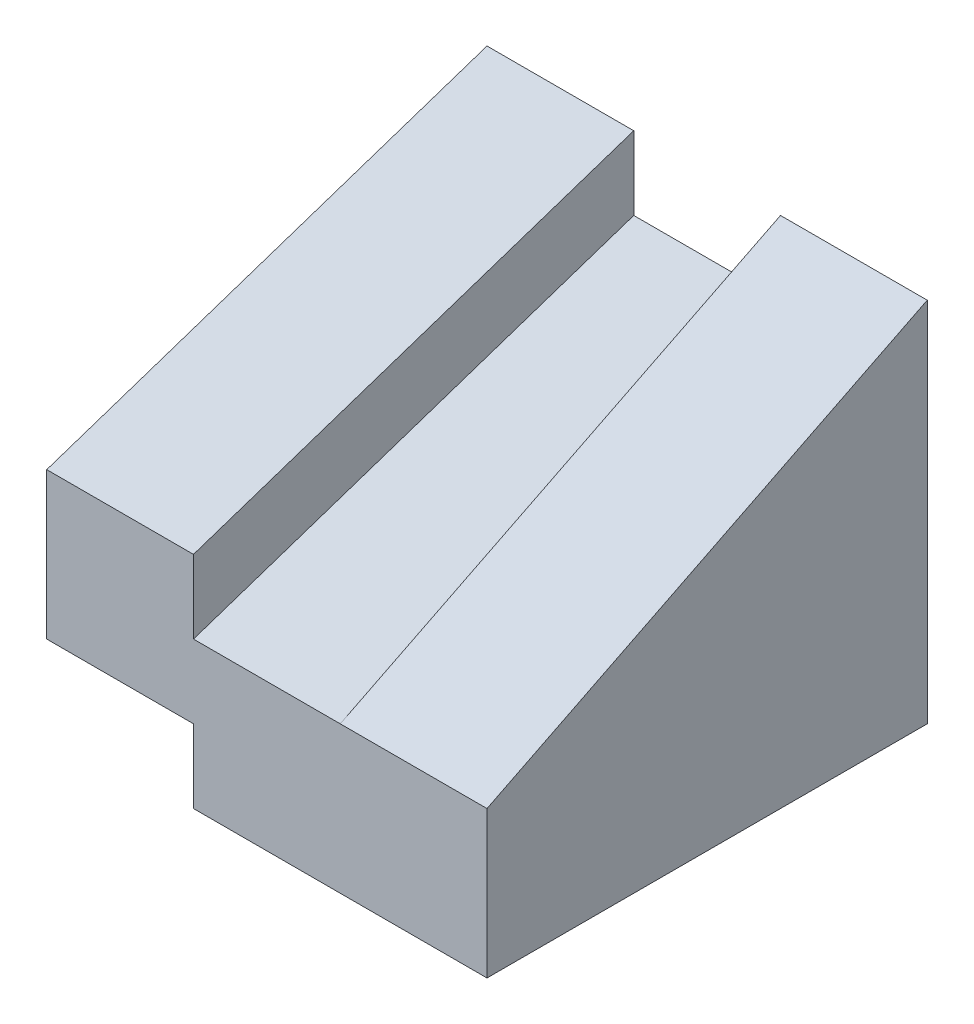
ISO-10303-21;
HEADER;
FILE_DESCRIPTION(('STEP AP214'),'2;1');
FILE_NAME('part.step','',(''),(''),'','','');
FILE_SCHEMA(('AUTOMOTIVE_DESIGN { 1 0 10303 214 1 1 1 1 }'));
ENDSEC;
DATA;
#1=APPLICATION_CONTEXT('core data for automotive mechanical design processes');
#2=APPLICATION_PROTOCOL_DEFINITION('international standard','automotive_design',2000,#1);
#3=PRODUCT_CONTEXT('',#1,'mechanical');
#4=PRODUCT('Part','Part','',(#3));
#5=PRODUCT_RELATED_PRODUCT_CATEGORY('part','',(#4));
#6=PRODUCT_DEFINITION_FORMATION('','',#4);
#7=PRODUCT_DEFINITION_CONTEXT('part definition',#1,'design');
#8=PRODUCT_DEFINITION('design','',#6,#7);
#9=PRODUCT_DEFINITION_SHAPE('','',#8);
#10=(LENGTH_UNIT() NAMED_UNIT(*) SI_UNIT(.MILLI.,.METRE.));
#11=(NAMED_UNIT(*) PLANE_ANGLE_UNIT() SI_UNIT($,.RADIAN.));
#12=(NAMED_UNIT(*) SI_UNIT($,.STERADIAN.) SOLID_ANGLE_UNIT());
#13=UNCERTAINTY_MEASURE_WITH_UNIT(LENGTH_MEASURE(1.E-05),#10,'distance_accuracy_value','');
#14=(GEOMETRIC_REPRESENTATION_CONTEXT(3) GLOBAL_UNCERTAINTY_ASSIGNED_CONTEXT((#13)) GLOBAL_UNIT_ASSIGNED_CONTEXT((#10,
#11,#12)) REPRESENTATION_CONTEXT('',''));
#15=CARTESIAN_POINT('',(0.,0.,0.));
#16=DIRECTION('',(0.,0.,1.));
#17=DIRECTION('',(1.,0.,0.));
#18=AXIS2_PLACEMENT_3D('',#15,#16,#17);
#19=CARTESIAN_POINT('',(-3.,5.,-3.));
#20=DIRECTION('',(0.,0.,1.));
#21=DIRECTION('',(1.,0.,0.));
#22=AXIS2_PLACEMENT_3D('',#19,#20,#21);
#23=PLANE('',#22);
#24=DIRECTION('',(0.,-1.,0.));
#25=VECTOR('',#24,1.);
#26=CARTESIAN_POINT('',(1.,0.,-3.));
#27=LINE('',#26,#25);
#28=CARTESIAN_POINT('',(1.,5.,-3.));
#29=VERTEX_POINT('',#28);
#30=CARTESIAN_POINT('',(1.,4.,-3.));
#31=VERTEX_POINT('',#30);
#32=EDGE_CURVE('E122',#29,#31,#27,.T.);
#33=ORIENTED_EDGE('',*,*,#32,.F.);
#34=DIRECTION('',(-1.,0.,0.));
#35=VECTOR('',#34,1.);
#36=CARTESIAN_POINT('',(-3.,5.,-3.));
#37=LINE('',#36,#35);
#38=CARTESIAN_POINT('',(3.,5.,-3.));
#39=VERTEX_POINT('',#38);
#40=EDGE_CURVE('E111',#39,#29,#37,.T.);
#41=ORIENTED_EDGE('',*,*,#40,.F.);
#42=DIRECTION('',(0.,-1.,0.));
#43=VECTOR('',#42,1.);
#44=CARTESIAN_POINT('',(3.,5.,-3.));
#45=LINE('',#44,#43);
#46=CARTESIAN_POINT('',(3.,0.,-3.));
#47=VERTEX_POINT('',#46);
#48=EDGE_CURVE('E11',#39,#47,#45,.T.);
#49=ORIENTED_EDGE('',*,*,#48,.T.);
#50=DIRECTION('',(-1.,0.,0.));
#51=VECTOR('',#50,1.);
#52=CARTESIAN_POINT('',(-3.,0.,-3.));
#53=LINE('',#52,#51);
#54=CARTESIAN_POINT('',(-1.,0.,-3.));
#55=VERTEX_POINT('',#54);
#56=EDGE_CURVE('E129',#47,#55,#53,.T.);
#57=ORIENTED_EDGE('',*,*,#56,.T.);
#58=DIRECTION('',(0.,1.,0.));
#59=VECTOR('',#58,1.);
#60=CARTESIAN_POINT('',(-1.,0.,-3.));
#61=LINE('',#60,#59);
#62=CARTESIAN_POINT('',(-1.,1.,-3.));
#63=VERTEX_POINT('',#62);
#64=EDGE_CURVE('E48',#55,#63,#61,.T.);
#65=ORIENTED_EDGE('',*,*,#64,.T.);
#66=DIRECTION('',(-1.,0.,0.));
#67=VECTOR('',#66,1.);
#68=CARTESIAN_POINT('',(-1.,1.,-3.));
#69=LINE('',#68,#67);
#70=CARTESIAN_POINT('',(-3.,1.,-3.));
#71=VERTEX_POINT('',#70);
#72=EDGE_CURVE('E154',#63,#71,#69,.T.);
#73=ORIENTED_EDGE('',*,*,#72,.T.);
#74=DIRECTION('',(0.,-1.,0.));
#75=VECTOR('',#74,1.);
#76=CARTESIAN_POINT('',(-3.,5.,-3.));
#77=LINE('',#76,#75);
#78=CARTESIAN_POINT('',(-3.,5.,-3.));
#79=VERTEX_POINT('',#78);
#80=EDGE_CURVE('E41',#79,#71,#77,.T.);
#81=ORIENTED_EDGE('',*,*,#80,.F.);
#82=DIRECTION('',(-1.,0.,0.));
#83=VECTOR('',#82,1.);
#84=CARTESIAN_POINT('',(-1.,5.,-3.));
#85=LINE('',#84,#83);
#86=CARTESIAN_POINT('',(-1.,5.,-3.));
#87=VERTEX_POINT('',#86);
#88=EDGE_CURVE('E134',#87,#79,#85,.T.);
#89=ORIENTED_EDGE('',*,*,#88,.F.);
#90=DIRECTION('',(0.,-1.,0.));
#91=VECTOR('',#90,1.);
#92=CARTESIAN_POINT('',(-1.,0.,-3.));
#93=LINE('',#92,#91);
#94=CARTESIAN_POINT('',(-1.,4.,-3.));
#95=VERTEX_POINT('',#94);
#96=EDGE_CURVE('E193',#87,#95,#93,.T.);
#97=ORIENTED_EDGE('',*,*,#96,.T.);
#98=DIRECTION('',(-1.,0.,0.));
#99=VECTOR('',#98,1.);
#100=CARTESIAN_POINT('',(1.,4.,-3.));
#101=LINE('',#100,#99);
#102=EDGE_CURVE('E186',#31,#95,#101,.T.);
#103=ORIENTED_EDGE('',*,*,#102,.F.);
#104=EDGE_LOOP('',(#33,#41,#49,#57,#65,#73,#81,#89,#97,#103));
#105=FACE_BOUND('',#104,.T.);
#106=ADVANCED_FACE('F33',(#105),#23,.F.);
#107=CARTESIAN_POINT('',(-3.,5.,3.));
#108=DIRECTION('',(0.,0.,-1.));
#109=DIRECTION('',(-1.,0.,0.));
#110=AXIS2_PLACEMENT_3D('',#107,#108,#109);
#111=PLANE('',#110);
#112=DIRECTION('',(0.,-1.,0.));
#113=VECTOR('',#112,1.);
#114=CARTESIAN_POINT('',(3.,5.,3.));
#115=LINE('',#114,#113);
#116=CARTESIAN_POINT('',(3.,2.,3.));
#117=VERTEX_POINT('',#116);
#118=CARTESIAN_POINT('',(3.,0.,3.));
#119=VERTEX_POINT('',#118);
#120=EDGE_CURVE('E56',#117,#119,#115,.T.);
#121=ORIENTED_EDGE('',*,*,#120,.F.);
#122=DIRECTION('',(-1.,0.,0.));
#123=VECTOR('',#122,1.);
#124=CARTESIAN_POINT('',(3.,2.,3.));
#125=LINE('',#124,#123);
#126=CARTESIAN_POINT('',(1.,2.,3.));
#127=VERTEX_POINT('',#126);
#128=EDGE_CURVE('E114',#117,#127,#125,.T.);
#129=ORIENTED_EDGE('',*,*,#128,.T.);
#130=DIRECTION('',(-1.,0.,0.));
#131=VECTOR('',#130,1.);
#132=CARTESIAN_POINT('',(1.,2.,3.));
#133=LINE('',#132,#131);
#134=CARTESIAN_POINT('',(-1.,2.,3.));
#135=VERTEX_POINT('',#134);
#136=EDGE_CURVE('E160',#127,#135,#133,.T.);
#137=ORIENTED_EDGE('',*,*,#136,.T.);
#138=DIRECTION('',(0.,1.,0.));
#139=VECTOR('',#138,1.);
#140=CARTESIAN_POINT('',(-1.,0.,3.));
#141=LINE('',#140,#139);
#142=CARTESIAN_POINT('',(-1.,3.,3.));
#143=VERTEX_POINT('',#142);
#144=EDGE_CURVE('E178',#135,#143,#141,.T.);
#145=ORIENTED_EDGE('',*,*,#144,.T.);
#146=DIRECTION('',(-1.,0.,0.));
#147=VECTOR('',#146,1.);
#148=CARTESIAN_POINT('',(-1.,3.,3.));
#149=LINE('',#148,#147);
#150=CARTESIAN_POINT('',(-3.,3.,3.));
#151=VERTEX_POINT('',#150);
#152=EDGE_CURVE('E130',#143,#151,#149,.T.);
#153=ORIENTED_EDGE('',*,*,#152,.T.);
#154=DIRECTION('',(0.,-1.,0.));
#155=VECTOR('',#154,1.);
#156=CARTESIAN_POINT('',(-3.,5.,3.));
#157=LINE('',#156,#155);
#158=CARTESIAN_POINT('',(-3.,1.,3.));
#159=VERTEX_POINT('',#158);
#160=EDGE_CURVE('E140',#151,#159,#157,.T.);
#161=ORIENTED_EDGE('',*,*,#160,.T.);
#162=DIRECTION('',(-1.,0.,0.));
#163=VECTOR('',#162,1.);
#164=CARTESIAN_POINT('',(-1.,1.,3.));
#165=LINE('',#164,#163);
#166=CARTESIAN_POINT('',(-1.,1.,3.));
#167=VERTEX_POINT('',#166);
#168=EDGE_CURVE('E156',#167,#159,#165,.T.);
#169=ORIENTED_EDGE('',*,*,#168,.F.);
#170=DIRECTION('',(0.,1.,0.));
#171=VECTOR('',#170,1.);
#172=CARTESIAN_POINT('',(-1.,0.,3.));
#173=LINE('',#172,#171);
#174=CARTESIAN_POINT('',(-1.,0.,3.));
#175=VERTEX_POINT('',#174);
#176=EDGE_CURVE('E167',#175,#167,#173,.T.);
#177=ORIENTED_EDGE('',*,*,#176,.F.);
#178=DIRECTION('',(1.,0.,0.));
#179=VECTOR('',#178,1.);
#180=CARTESIAN_POINT('',(-3.,0.,3.));
#181=LINE('',#180,#179);
#182=EDGE_CURVE('E123',#175,#119,#181,.T.);
#183=ORIENTED_EDGE('',*,*,#182,.T.);
#184=EDGE_LOOP('',(#121,#129,#137,#145,#153,#161,#169,#177,#183));
#185=FACE_BOUND('',#184,.T.);
#186=ADVANCED_FACE('F174',(#185),#111,.F.);
#187=CARTESIAN_POINT('',(-3.,5.,3.));
#188=DIRECTION('',(1.,0.,0.));
#189=DIRECTION('',(0.,0.,-1.));
#190=AXIS2_PLACEMENT_3D('',#187,#188,#189);
#191=PLANE('',#190);
#192=ORIENTED_EDGE('',*,*,#160,.F.);
#193=DIRECTION('',(0.,-0.316227766016838,0.948683298050514));
#194=VECTOR('',#193,1.);
#195=CARTESIAN_POINT('',(-3.,3.6,1.2));
#196=LINE('',#195,#194);
#197=EDGE_CURVE('E150',#79,#151,#196,.T.);
#198=ORIENTED_EDGE('',*,*,#197,.F.);
#199=ORIENTED_EDGE('',*,*,#80,.T.);
#200=DIRECTION('',(0.,0.,1.));
#201=VECTOR('',#200,1.);
#202=CARTESIAN_POINT('',(-3.,1.,-3.));
#203=LINE('',#202,#201);
#204=EDGE_CURVE('E149',#71,#159,#203,.T.);
#205=ORIENTED_EDGE('',*,*,#204,.T.);
#206=EDGE_LOOP('',(#192,#198,#199,#205));
#207=FACE_BOUND('',#206,.T.);
#208=ADVANCED_FACE('F148',(#207),#191,.F.);
#209=CARTESIAN_POINT('',(0.,0.,0.));
#210=DIRECTION('',(0.,-1.,0.));
#211=DIRECTION('',(0.,0.,-1.));
#212=AXIS2_PLACEMENT_3D('',#209,#210,#211);
#213=PLANE('',#212);
#214=ORIENTED_EDGE('',*,*,#182,.F.);
#215=DIRECTION('',(0.,0.,1.));
#216=VECTOR('',#215,1.);
#217=CARTESIAN_POINT('',(-1.,0.,-3.));
#218=LINE('',#217,#216);
#219=EDGE_CURVE('E158',#55,#175,#218,.T.);
#220=ORIENTED_EDGE('',*,*,#219,.F.);
#221=ORIENTED_EDGE('',*,*,#56,.F.);
#222=DIRECTION('',(0.,0.,-1.));
#223=VECTOR('',#222,1.);
#224=CARTESIAN_POINT('',(3.,0.,3.));
#225=LINE('',#224,#223);
#226=EDGE_CURVE('E126',#119,#47,#225,.T.);
#227=ORIENTED_EDGE('',*,*,#226,.F.);
#228=EDGE_LOOP('',(#214,#220,#221,#227));
#229=FACE_BOUND('',#228,.T.);
#230=ADVANCED_FACE('F225',(#229),#213,.T.);
#231=CARTESIAN_POINT('',(3.,5.,3.));
#232=DIRECTION('',(-1.,0.,0.));
#233=DIRECTION('',(0.,0.,1.));
#234=AXIS2_PLACEMENT_3D('',#231,#232,#233);
#235=PLANE('',#234);
#236=ORIENTED_EDGE('',*,*,#48,.F.);
#237=DIRECTION('',(0.,-0.447213595499958,0.894427190999916));
#238=VECTOR('',#237,1.);
#239=CARTESIAN_POINT('',(3.,2.8,1.4));
#240=LINE('',#239,#238);
#241=EDGE_CURVE('E108',#39,#117,#240,.T.);
#242=ORIENTED_EDGE('',*,*,#241,.T.);
#243=ORIENTED_EDGE('',*,*,#120,.T.);
#244=ORIENTED_EDGE('',*,*,#226,.T.);
#245=EDGE_LOOP('',(#236,#242,#243,#244));
#246=FACE_BOUND('',#245,.T.);
#247=ADVANCED_FACE('F35',(#246),#235,.F.);
#248=CARTESIAN_POINT('',(-1.,1.,-3.));
#249=DIRECTION('',(0.,-1.,0.));
#250=DIRECTION('',(0.,0.,-1.));
#251=AXIS2_PLACEMENT_3D('',#248,#249,#250);
#252=PLANE('',#251);
#253=ORIENTED_EDGE('',*,*,#204,.F.);
#254=ORIENTED_EDGE('',*,*,#72,.F.);
#255=DIRECTION('',(0.,0.,1.));
#256=VECTOR('',#255,1.);
#257=CARTESIAN_POINT('',(-1.,1.,-3.));
#258=LINE('',#257,#256);
#259=EDGE_CURVE('E164',#63,#167,#258,.T.);
#260=ORIENTED_EDGE('',*,*,#259,.T.);
#261=ORIENTED_EDGE('',*,*,#168,.T.);
#262=EDGE_LOOP('',(#253,#254,#260,#261));
#263=FACE_BOUND('',#262,.T.);
#264=ADVANCED_FACE('F169',(#263),#252,.T.);
#265=CARTESIAN_POINT('',(-1.,0.,0.));
#266=DIRECTION('',(-1.,0.,0.));
#267=DIRECTION('',(0.,0.,1.));
#268=AXIS2_PLACEMENT_3D('',#265,#266,#267);
#269=PLANE('',#268);
#270=ORIENTED_EDGE('',*,*,#259,.F.);
#271=ORIENTED_EDGE('',*,*,#64,.F.);
#272=ORIENTED_EDGE('',*,*,#219,.T.);
#273=ORIENTED_EDGE('',*,*,#176,.T.);
#274=EDGE_LOOP('',(#270,#271,#272,#273));
#275=FACE_BOUND('',#274,.T.);
#276=ADVANCED_FACE('F172',(#275),#269,.T.);
#277=CARTESIAN_POINT('',(-1.,3.6,1.2));
#278=DIRECTION('',(0.,-0.948683298050514,-0.316227766016838));
#279=DIRECTION('',(0.,0.316227766016838,-0.948683298050514));
#280=AXIS2_PLACEMENT_3D('',#277,#278,#279);
#281=PLANE('',#280);
#282=ORIENTED_EDGE('',*,*,#197,.T.);
#283=ORIENTED_EDGE('',*,*,#152,.F.);
#284=DIRECTION('',(0.,-0.316227766016838,0.948683298050514));
#285=VECTOR('',#284,1.);
#286=CARTESIAN_POINT('',(-1.,3.6,1.2));
#287=LINE('',#286,#285);
#288=EDGE_CURVE('E182',#87,#143,#287,.T.);
#289=ORIENTED_EDGE('',*,*,#288,.F.);
#290=ORIENTED_EDGE('',*,*,#88,.T.);
#291=EDGE_LOOP('',(#282,#283,#289,#290));
#292=FACE_BOUND('',#291,.T.);
#293=ADVANCED_FACE('F181',(#292),#281,.F.);
#294=CARTESIAN_POINT('',(-1.,0.,0.));
#295=DIRECTION('',(-1.,0.,0.));
#296=DIRECTION('',(0.,0.,1.));
#297=AXIS2_PLACEMENT_3D('',#294,#295,#296);
#298=PLANE('',#297);
#299=ORIENTED_EDGE('',*,*,#144,.F.);
#300=DIRECTION('',(0.,-0.316227766016838,0.948683298050514));
#301=VECTOR('',#300,1.);
#302=CARTESIAN_POINT('',(-1.,2.7,0.9));
#303=LINE('',#302,#301);
#304=EDGE_CURVE('E190',#95,#135,#303,.T.);
#305=ORIENTED_EDGE('',*,*,#304,.F.);
#306=ORIENTED_EDGE('',*,*,#96,.F.);
#307=ORIENTED_EDGE('',*,*,#288,.T.);
#308=EDGE_LOOP('',(#299,#305,#306,#307));
#309=FACE_BOUND('',#308,.T.);
#310=ADVANCED_FACE('F214',(#309),#298,.F.);
#311=CARTESIAN_POINT('',(1.,2.7,0.9));
#312=DIRECTION('',(0.,-0.948683298050514,-0.316227766016838));
#313=DIRECTION('',(0.,0.316227766016838,-0.948683298050514));
#314=AXIS2_PLACEMENT_3D('',#311,#312,#313);
#315=PLANE('',#314);
#316=ORIENTED_EDGE('',*,*,#304,.T.);
#317=ORIENTED_EDGE('',*,*,#136,.F.);
#318=DIRECTION('',(0.,-0.316227766016838,0.948683298050514));
#319=VECTOR('',#318,1.);
#320=CARTESIAN_POINT('',(1.,2.7,0.9));
#321=LINE('',#320,#319);
#322=EDGE_CURVE('E188',#31,#127,#321,.T.);
#323=ORIENTED_EDGE('',*,*,#322,.F.);
#324=ORIENTED_EDGE('',*,*,#102,.T.);
#325=EDGE_LOOP('',(#316,#317,#323,#324));
#326=FACE_BOUND('',#325,.T.);
#327=ADVANCED_FACE('F204',(#326),#315,.F.);
#328=CARTESIAN_POINT('',(1.,0.,0.));
#329=DIRECTION('',(-1.,0.,0.));
#330=DIRECTION('',(0.,0.,1.));
#331=AXIS2_PLACEMENT_3D('',#328,#329,#330);
#332=PLANE('',#331);
#333=DIRECTION('',(0.,-0.447213595499958,0.894427190999916));
#334=VECTOR('',#333,1.);
#335=CARTESIAN_POINT('',(1.,2.8,1.4));
#336=LINE('',#335,#334);
#337=EDGE_CURVE('E116',#29,#127,#336,.T.);
#338=ORIENTED_EDGE('',*,*,#337,.F.);
#339=ORIENTED_EDGE('',*,*,#32,.T.);
#340=ORIENTED_EDGE('',*,*,#322,.T.);
#341=EDGE_LOOP('',(#338,#339,#340));
#342=FACE_BOUND('',#341,.T.);
#343=ADVANCED_FACE('F206',(#342),#332,.T.);
#344=CARTESIAN_POINT('',(3.,2.8,1.4));
#345=DIRECTION('',(0.,-0.894427190999916,-0.447213595499958));
#346=DIRECTION('',(0.,0.447213595499958,-0.894427190999916));
#347=AXIS2_PLACEMENT_3D('',#344,#345,#346);
#348=PLANE('',#347);
#349=ORIENTED_EDGE('',*,*,#337,.T.);
#350=ORIENTED_EDGE('',*,*,#128,.F.);
#351=ORIENTED_EDGE('',*,*,#241,.F.);
#352=ORIENTED_EDGE('',*,*,#40,.T.);
#353=EDGE_LOOP('',(#349,#350,#351,#352));
#354=FACE_BOUND('',#353,.T.);
#355=ADVANCED_FACE('F110',(#354),#348,.F.);
#356=CLOSED_SHELL('',(#106,#186,#208,#230,#247,#264,#276,#293,#310,#327,#343,#355));
#357=MANIFOLD_SOLID_BREP('B2',#356);
#358=ADVANCED_BREP_SHAPE_REPRESENTATION('',(#18,#357),#14);
#359=SHAPE_DEFINITION_REPRESENTATION(#9,#358);
ENDSEC;
END-ISO-10303-21;
